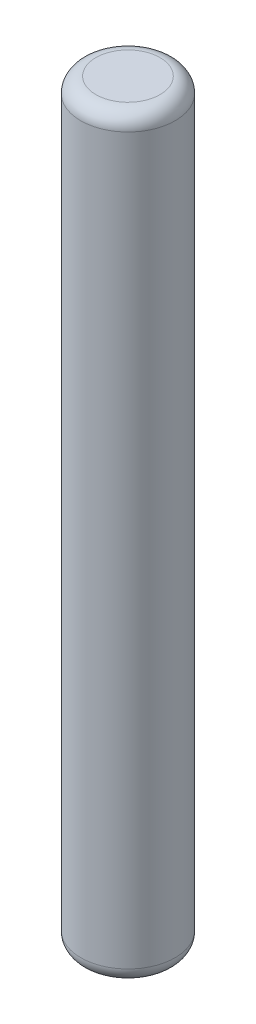
ISO-10303-21;
HEADER;
FILE_DESCRIPTION(('STEP AP214'),'2;1');
FILE_NAME('part.step','',(''),(''),'','','');
FILE_SCHEMA(('AUTOMOTIVE_DESIGN { 1 0 10303 214 1 1 1 1 }'));
ENDSEC;
DATA;
#1=APPLICATION_CONTEXT('core data for automotive mechanical design processes');
#2=APPLICATION_PROTOCOL_DEFINITION('international standard','automotive_design',2000,#1);
#3=PRODUCT_CONTEXT('',#1,'mechanical');
#4=PRODUCT('Part','Part','',(#3));
#5=PRODUCT_RELATED_PRODUCT_CATEGORY('part','',(#4));
#6=PRODUCT_DEFINITION_FORMATION('','',#4);
#7=PRODUCT_DEFINITION_CONTEXT('part definition',#1,'design');
#8=PRODUCT_DEFINITION('design','',#6,#7);
#9=PRODUCT_DEFINITION_SHAPE('','',#8);
#10=(LENGTH_UNIT() NAMED_UNIT(*) SI_UNIT(.MILLI.,.METRE.));
#11=(NAMED_UNIT(*) PLANE_ANGLE_UNIT() SI_UNIT($,.RADIAN.));
#12=(NAMED_UNIT(*) SI_UNIT($,.STERADIAN.) SOLID_ANGLE_UNIT());
#13=UNCERTAINTY_MEASURE_WITH_UNIT(LENGTH_MEASURE(1.E-05),#10,'distance_accuracy_value','');
#14=(GEOMETRIC_REPRESENTATION_CONTEXT(3) GLOBAL_UNCERTAINTY_ASSIGNED_CONTEXT((#13)) GLOBAL_UNIT_ASSIGNED_CONTEXT((#10,
#11,#12)) REPRESENTATION_CONTEXT('',''));
#15=CARTESIAN_POINT('',(0.,0.,0.));
#16=DIRECTION('',(0.,0.,1.));
#17=DIRECTION('',(1.,0.,0.));
#18=AXIS2_PLACEMENT_3D('',#15,#16,#17);
#19=CARTESIAN_POINT('',(0.,25.4,0.));
#20=DIRECTION('',(0.,-1.,0.));
#21=DIRECTION('',(0.,0.,-1.));
#22=AXIS2_PLACEMENT_3D('',#19,#20,#21);
#23=CYLINDRICAL_SURFACE('',#22,1.5875);
#24=CARTESIAN_POINT('',(0.,0.508000000000002,0.));
#25=DIRECTION('',(0.,1.,0.));
#26=DIRECTION('',(0.,0.,1.));
#27=AXIS2_PLACEMENT_3D('',#24,#25,#26);
#28=CIRCLE('',#27,1.5875);
#29=CARTESIAN_POINT('',(0.,0.508000000000002,1.5875));
#30=VERTEX_POINT('',#29);
#31=EDGE_CURVE('E41',#30,#30,#28,.T.);
#32=ORIENTED_EDGE('',*,*,#31,.T.);
#33=EDGE_LOOP('',(#32));
#34=FACE_BOUND('',#33,.T.);
#35=CARTESIAN_POINT('',(0.,24.892,0.));
#36=DIRECTION('',(0.,1.,0.));
#37=DIRECTION('',(0.,0.,1.));
#38=AXIS2_PLACEMENT_3D('',#35,#36,#37);
#39=CIRCLE('',#38,1.5875);
#40=CARTESIAN_POINT('',(0.,24.892,1.5875));
#41=VERTEX_POINT('',#40);
#42=EDGE_CURVE('E45',#41,#41,#39,.F.);
#43=ORIENTED_EDGE('',*,*,#42,.T.);
#44=EDGE_LOOP('',(#43));
#45=FACE_BOUND('',#44,.T.);
#46=ADVANCED_FACE('F30',(#34,#45),#23,.T.);
#47=CARTESIAN_POINT('',(0.,25.4,0.));
#48=DIRECTION('',(0.,1.,0.));
#49=DIRECTION('',(0.,0.,1.));
#50=AXIS2_PLACEMENT_3D('',#47,#48,#49);
#51=PLANE('',#50);
#52=CARTESIAN_POINT('',(0.,25.4,0.));
#53=DIRECTION('',(0.,1.,0.));
#54=DIRECTION('',(0.,0.,1.));
#55=AXIS2_PLACEMENT_3D('',#52,#53,#54);
#56=CIRCLE('',#55,1.0795);
#57=CARTESIAN_POINT('',(0.,25.4,1.0795));
#58=VERTEX_POINT('',#57);
#59=EDGE_CURVE('E10',#58,#58,#56,.T.);
#60=ORIENTED_EDGE('',*,*,#59,.T.);
#61=EDGE_LOOP('',(#60));
#62=FACE_BOUND('',#61,.T.);
#63=ADVANCED_FACE('F61',(#62),#51,.T.);
#64=CARTESIAN_POINT('',(0.,0.,0.));
#65=DIRECTION('',(0.,1.,0.));
#66=DIRECTION('',(0.,0.,1.));
#67=AXIS2_PLACEMENT_3D('',#64,#65,#66);
#68=PLANE('',#67);
#69=CARTESIAN_POINT('',(0.,0.,0.));
#70=DIRECTION('',(0.,1.,0.));
#71=DIRECTION('',(0.,0.,1.));
#72=AXIS2_PLACEMENT_3D('',#69,#70,#71);
#73=CIRCLE('',#72,1.0795);
#74=CARTESIAN_POINT('',(0.,0.,1.0795));
#75=VERTEX_POINT('',#74);
#76=EDGE_CURVE('E37',#75,#75,#73,.F.);
#77=ORIENTED_EDGE('',*,*,#76,.T.);
#78=EDGE_LOOP('',(#77));
#79=FACE_BOUND('',#78,.T.);
#80=ADVANCED_FACE('F58',(#79),#68,.F.);
#81=CARTESIAN_POINT('',(0.,0.508000000000002,0.));
#82=DIRECTION('',(0.,1.,0.));
#83=DIRECTION('',(0.,0.,1.));
#84=AXIS2_PLACEMENT_3D('',#81,#82,#83);
#85=TOROIDAL_SURFACE('',#84,1.0795,0.508);
#86=ORIENTED_EDGE('',*,*,#76,.F.);
#87=EDGE_LOOP('',(#86));
#88=FACE_BOUND('',#87,.T.);
#89=ORIENTED_EDGE('',*,*,#31,.F.);
#90=EDGE_LOOP('',(#89));
#91=FACE_BOUND('',#90,.T.);
#92=ADVANCED_FACE('F54',(#88,#91),#85,.T.);
#93=CARTESIAN_POINT('',(0.,24.892,0.));
#94=DIRECTION('',(0.,1.,0.));
#95=DIRECTION('',(0.,0.,1.));
#96=AXIS2_PLACEMENT_3D('',#93,#94,#95);
#97=TOROIDAL_SURFACE('',#96,1.0795,0.508);
#98=ORIENTED_EDGE('',*,*,#42,.F.);
#99=EDGE_LOOP('',(#98));
#100=FACE_BOUND('',#99,.T.);
#101=ORIENTED_EDGE('',*,*,#59,.F.);
#102=EDGE_LOOP('',(#101));
#103=FACE_BOUND('',#102,.T.);
#104=ADVANCED_FACE('F32',(#100,#103),#97,.T.);
#105=CLOSED_SHELL('',(#46,#63,#80,#92,#104));
#106=MANIFOLD_SOLID_BREP('B2',#105);
#107=ADVANCED_BREP_SHAPE_REPRESENTATION('',(#18,#106),#14);
#108=SHAPE_DEFINITION_REPRESENTATION(#9,#107);
ENDSEC;
END-ISO-10303-21;
